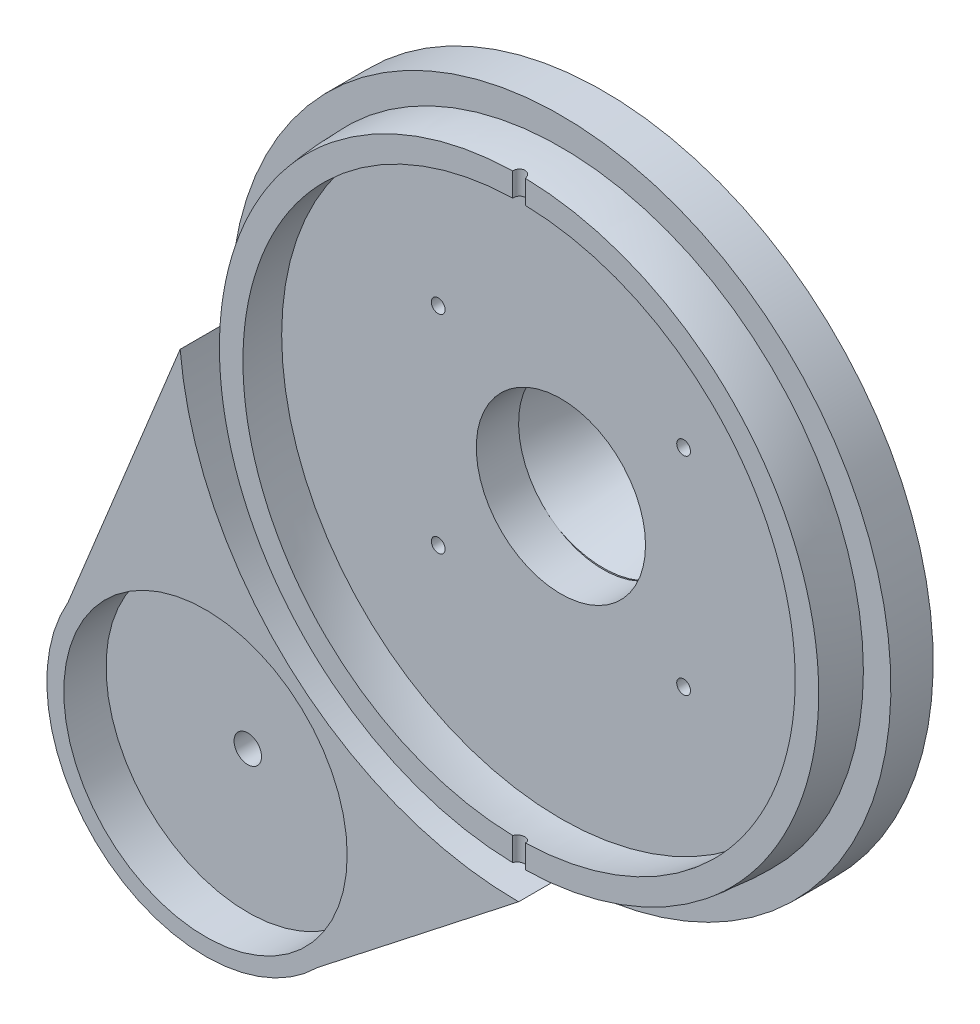
ISO-10303-21;
HEADER;
FILE_DESCRIPTION(('STEP AP214'),'2;1');
FILE_NAME('part.step','',(''),(''),'','','');
FILE_SCHEMA(('AUTOMOTIVE_DESIGN { 1 0 10303 214 1 1 1 1 }'));
ENDSEC;
DATA;
#1=APPLICATION_CONTEXT('core data for automotive mechanical design processes');
#2=APPLICATION_PROTOCOL_DEFINITION('international standard','automotive_design',2000,#1);
#3=PRODUCT_CONTEXT('',#1,'mechanical');
#4=PRODUCT('Part','Part','',(#3));
#5=PRODUCT_RELATED_PRODUCT_CATEGORY('part','',(#4));
#6=PRODUCT_DEFINITION_FORMATION('','',#4);
#7=PRODUCT_DEFINITION_CONTEXT('part definition',#1,'design');
#8=PRODUCT_DEFINITION('design','',#6,#7);
#9=PRODUCT_DEFINITION_SHAPE('','',#8);
#10=(LENGTH_UNIT() NAMED_UNIT(*) SI_UNIT(.MILLI.,.METRE.));
#11=(NAMED_UNIT(*) PLANE_ANGLE_UNIT() SI_UNIT($,.RADIAN.));
#12=(NAMED_UNIT(*) SI_UNIT($,.STERADIAN.) SOLID_ANGLE_UNIT());
#13=UNCERTAINTY_MEASURE_WITH_UNIT(LENGTH_MEASURE(1.E-05),#10,'distance_accuracy_value','');
#14=(GEOMETRIC_REPRESENTATION_CONTEXT(3) GLOBAL_UNCERTAINTY_ASSIGNED_CONTEXT((#13)) GLOBAL_UNIT_ASSIGNED_CONTEXT((#10,
#11,#12)) REPRESENTATION_CONTEXT('',''));
#15=CARTESIAN_POINT('',(0.,0.,0.));
#16=DIRECTION('',(0.,0.,1.));
#17=DIRECTION('',(1.,0.,0.));
#18=AXIS2_PLACEMENT_3D('',#15,#16,#17);
#19=CARTESIAN_POINT('',(0.,0.,0.));
#20=DIRECTION('',(0.,0.,1.));
#21=DIRECTION('',(1.,0.,0.));
#22=AXIS2_PLACEMENT_3D('',#19,#20,#21);
#23=PLANE('',#22);
#24=CARTESIAN_POINT('',(0.,0.,0.));
#25=DIRECTION('',(0.,0.,-1.));
#26=DIRECTION('',(-1.,0.,0.));
#27=AXIS2_PLACEMENT_3D('',#24,#25,#26);
#28=CIRCLE('',#27,71.5);
#29=CARTESIAN_POINT('',(-71.5,0.,0.));
#30=VERTEX_POINT('',#29);
#31=EDGE_CURVE('E621',#30,#30,#28,.T.);
#32=ORIENTED_EDGE('',*,*,#31,.T.);
#33=EDGE_LOOP('',(#32));
#34=FACE_BOUND('',#33,.T.);
#35=CARTESIAN_POINT('',(0.,2.32165108694269,0.));
#36=DIRECTION('',(0.,0.,1.));
#37=DIRECTION('',(1.,0.,0.));
#38=AXIS2_PLACEMENT_3D('',#35,#36,#37);
#39=CIRCLE('',#38,80.3216510869438);
#40=CARTESIAN_POINT('',(-79.9963372707255,-4.90009777334602,0.));
#41=VERTEX_POINT('',#40);
#42=CARTESIAN_POINT('',(0.,-78.0000000000012,0.));
#43=VERTEX_POINT('',#42);
#44=EDGE_CURVE('E80',#41,#43,#39,.T.);
#45=ORIENTED_EDGE('',*,*,#44,.T.);
#46=CARTESIAN_POINT('',(0.,0.,0.));
#47=DIRECTION('',(0.,0.,1.));
#48=DIRECTION('',(1.,0.,0.));
#49=AXIS2_PLACEMENT_3D('',#46,#47,#48);
#50=CIRCLE('',#49,78.0000000000012);
#51=CARTESIAN_POINT('',(-78.0000000000012,0.,0.));
#52=VERTEX_POINT('',#51);
#53=EDGE_CURVE('E216',#43,#52,#50,.T.);
#54=ORIENTED_EDGE('',*,*,#53,.T.);
#55=DIRECTION('',(-0.377297072233503,-0.926092284431755,0.));
#56=VECTOR('',#55,1.);
#57=CARTESIAN_POINT('',(-66.8964597041551,27.2541287876631,0.));
#58=LINE('',#57,#56);
#59=EDGE_CURVE('E76',#52,#41,#58,.T.);
#60=ORIENTED_EDGE('',*,*,#59,.T.);
#61=EDGE_LOOP('',(#45,#54,#60));
#62=FACE_BOUND('',#61,.T.);
#63=ADVANCED_FACE('F58',(#34,#62),#23,.T.);
#64=CARTESIAN_POINT('',(-74.0070931617323,-88.6746872661566,0.));
#65=DIRECTION('',(0.,0.,-1.));
#66=DIRECTION('',(-1.,0.,0.));
#67=AXIS2_PLACEMENT_3D('',#64,#65,#66);
#68=CIRCLE('',#67,3.25000000000001);
#69=CARTESIAN_POINT('',(-77.2570931617323,-88.6746872661566,0.));
#70=VERTEX_POINT('',#69);
#71=EDGE_CURVE('E177',#70,#70,#68,.T.);
#72=ORIENTED_EDGE('',*,*,#71,.T.);
#73=EDGE_LOOP('',(#72));
#74=FACE_BOUND('',#73,.T.);
#75=CARTESIAN_POINT('',(-74.0070931617323,-88.6746872661566,0.));
#76=DIRECTION('',(0.,0.,1.));
#77=DIRECTION('',(1.,0.,0.));
#78=AXIS2_PLACEMENT_3D('',#75,#76,#77);
#79=CIRCLE('',#78,33.5);
#80=CARTESIAN_POINT('',(-40.5070931617323,-88.6746872661566,0.));
#81=VERTEX_POINT('',#80);
#82=EDGE_CURVE('E12',#81,#81,#79,.F.);
#83=ORIENTED_EDGE('',*,*,#82,.F.);
#84=EDGE_LOOP('',(#83));
#85=FACE_BOUND('',#84,.T.);
#86=ADVANCED_FACE('F278',(#74,#85),#23,.T.);
#87=CARTESIAN_POINT('',(0.,0.,-10.));
#88=DIRECTION('',(0.,0.,1.));
#89=DIRECTION('',(1.,0.,0.));
#90=AXIS2_PLACEMENT_3D('',#87,#88,#89);
#91=CYLINDRICAL_SURFACE('',#90,78.0000000000012);
#92=ORIENTED_EDGE('',*,*,#53,.F.);
#93=DIRECTION('',(0.,0.,-1.));
#94=VECTOR('',#93,1.);
#95=CARTESIAN_POINT('',(0.,-78.0000000000011,0.));
#96=LINE('',#95,#94);
#97=CARTESIAN_POINT('',(0.,-78.0000000000011,-10.));
#98=VERTEX_POINT('',#97);
#99=EDGE_CURVE('E193',#43,#98,#96,.T.);
#100=ORIENTED_EDGE('',*,*,#99,.T.);
#101=CARTESIAN_POINT('',(0.,0.,-10.));
#102=DIRECTION('',(0.,0.,1.));
#103=DIRECTION('',(1.,0.,0.));
#104=AXIS2_PLACEMENT_3D('',#101,#102,#103);
#105=CIRCLE('',#104,78.0000000000012);
#106=CARTESIAN_POINT('',(-78.0000000000012,0.,-10.));
#107=VERTEX_POINT('',#106);
#108=EDGE_CURVE('E203',#98,#107,#105,.T.);
#109=ORIENTED_EDGE('',*,*,#108,.T.);
#110=DIRECTION('',(0.,0.,-1.));
#111=VECTOR('',#110,1.);
#112=CARTESIAN_POINT('',(-78.0000000000012,0.,0.));
#113=LINE('',#112,#111);
#114=EDGE_CURVE('E196',#52,#107,#113,.T.);
#115=ORIENTED_EDGE('',*,*,#114,.F.);
#116=EDGE_LOOP('',(#92,#100,#109,#115));
#117=FACE_BOUND('',#116,.T.);
#118=ADVANCED_FACE('F243',(#117),#91,.T.);
#119=CARTESIAN_POINT('',(0.,0.,9.88765871070188));
#120=DIRECTION('',(0.,0.,1.));
#121=DIRECTION('',(1.,0.,0.));
#122=AXIS2_PLACEMENT_3D('',#119,#120,#121);
#123=PLANE('',#122);
#124=DIRECTION('',(0.,1.,0.));
#125=VECTOR('',#124,1.);
#126=CARTESIAN_POINT('',(1.49578722909338,-78.0000000000012,9.88765871070189));
#127=LINE('',#126,#125);
#128=CARTESIAN_POINT('',(1.49578722909338,-70.7972232914961,9.88765871070189));
#129=VERTEX_POINT('',#128);
#130=CARTESIAN_POINT('',(1.49578722909338,-65.2380013932521,9.88765871070189));
#131=VERTEX_POINT('',#130);
#132=EDGE_CURVE('E68',#129,#131,#127,.T.);
#133=ORIENTED_EDGE('',*,*,#132,.F.);
#134=CARTESIAN_POINT('',(0.,0.,9.88765871070188));
#135=DIRECTION('',(0.,0.,1.));
#136=DIRECTION('',(1.,0.,0.));
#137=AXIS2_PLACEMENT_3D('',#134,#135,#136);
#138=CIRCLE('',#137,70.8130228504664);
#139=CARTESIAN_POINT('',(1.49578722909338,70.7972232914961,9.88765871070189));
#140=VERTEX_POINT('',#139);
#141=EDGE_CURVE('E260',#129,#140,#138,.T.);
#142=ORIENTED_EDGE('',*,*,#141,.T.);
#143=CARTESIAN_POINT('',(1.49578722909338,65.2380013932521,9.88765871070189));
#144=VERTEX_POINT('',#143);
#145=EDGE_CURVE('E612',#144,#140,#127,.T.);
#146=ORIENTED_EDGE('',*,*,#145,.F.);
#147=CARTESIAN_POINT('',(0.,0.,9.88765871070188));
#148=DIRECTION('',(0.,0.,1.));
#149=DIRECTION('',(1.,0.,0.));
#150=AXIS2_PLACEMENT_3D('',#147,#148,#149);
#151=CIRCLE('',#150,65.2551469634441);
#152=EDGE_CURVE('E261',#144,#131,#151,.F.);
#153=ORIENTED_EDGE('',*,*,#152,.T.);
#154=EDGE_LOOP('',(#133,#142,#146,#153));
#155=FACE_BOUND('',#154,.T.);
#156=ADVANCED_FACE('F266',(#155),#123,.T.);
#157=CARTESIAN_POINT('',(0.,0.,0.));
#158=DIRECTION('',(-1.,0.,0.));
#159=DIRECTION('',(0.,1.,0.));
#160=AXIS2_PLACEMENT_3D('',#157,#158,#159);
#161=SPHERICAL_SURFACE('',#160,66.);
#162=CARTESIAN_POINT('',(0.,0.,0.));
#163=DIRECTION('',(0.,0.,1.));
#164=DIRECTION('',(-1.,0.,0.));
#165=AXIS2_PLACEMENT_3D('',#162,#163,#164);
#166=CIRCLE('',#165,66.);
#167=CARTESIAN_POINT('',(-66.,0.,0.));
#168=VERTEX_POINT('',#167);
#169=EDGE_CURVE('E314',#168,#168,#166,.T.);
#170=ORIENTED_EDGE('',*,*,#169,.F.);
#171=EDGE_LOOP('',(#170));
#172=FACE_BOUND('',#171,.T.);
#173=ORIENTED_EDGE('',*,*,#152,.F.);
#174=CARTESIAN_POINT('',(1.49580223667257,65.2379707362664,9.88785871070234));
#175=CARTESIAN_POINT('',(1.49262410187074,65.2444676252272,9.84547436025111));
#176=CARTESIAN_POINT('',(1.48764573330495,65.2509402491417,9.80324190147573));
#177=CARTESIAN_POINT('',(1.474122516832,65.2637974516512,9.7193391709444));
#178=CARTESIAN_POINT('',(1.46557772843855,65.2701820317135,9.67766888981923));
#179=CARTESIAN_POINT('',(1.43466963356243,65.289129330821,9.55398750293752));
#180=CARTESIAN_POINT('',(1.40702466359359,65.3015016595283,9.47320113894301));
#181=CARTESIAN_POINT('',(1.33838207350703,65.3253621405282,9.31736020511043));
#182=CARTESIAN_POINT('',(1.2973762482151,65.3368497441196,9.24230919252319));
#183=CARTESIAN_POINT('',(1.20313074829694,65.3586050843083,9.1001429909393));
#184=CARTESIAN_POINT('',(1.14989484028291,65.3688731950102,9.03302536824173));
#185=CARTESIAN_POINT('',(1.03302146392251,65.3878293631549,8.90909303465792));
#186=CARTESIAN_POINT('',(0.969450347937833,65.3965267980916,8.85221718302946));
#187=CARTESIAN_POINT('',(0.833444958537618,65.4121618718752,8.74995702812555));
#188=CARTESIAN_POINT('',(0.761009731881607,65.4190993212073,8.70457396239015));
#189=CARTESIAN_POINT('',(0.61022233542998,65.430934076958,8.62714503010273));
#190=CARTESIAN_POINT('',(0.531946524793048,65.4358536130643,8.59495384341899));
#191=CARTESIAN_POINT('',(0.3710114013796,65.4436154719849,8.54416045738107));
#192=CARTESIAN_POINT('',(0.288352610338821,65.4464580414418,8.52555664450769));
#193=CARTESIAN_POINT('',(0.121822096570623,65.4499631883822,8.50261608609233));
#194=CARTESIAN_POINT('',(0.0379688956901759,65.4506458653412,8.4981477985604));
#195=CARTESIAN_POINT('',(-0.129298920513545,65.4498674235649,8.50324271926474));
#196=CARTESIAN_POINT('',(-0.212713546732094,65.4484063583402,8.51280557726407));
#197=CARTESIAN_POINT('',(-0.376447104407086,65.4433931516693,8.54561494853893));
#198=CARTESIAN_POINT('',(-0.456775485730177,65.4398480444895,8.56881543072282));
#199=CARTESIAN_POINT('',(-0.612378577924732,65.4307778336302,8.62816662637793));
#200=CARTESIAN_POINT('',(-0.687653027614257,65.4252526277147,8.66431800852749));
#201=CARTESIAN_POINT('',(-0.831355552130187,65.4123579457064,8.74867347739999));
#202=CARTESIAN_POINT('',(-0.899754315473752,65.4049810067737,8.79692633467424));
#203=CARTESIAN_POINT('',(-1.02747944630808,65.3886090895122,8.90399340848082));
#204=CARTESIAN_POINT('',(-1.08680624565288,65.3796141882478,8.96280712199318));
#205=CARTESIAN_POINT('',(-1.19533296476678,65.3601678334868,9.08992780085658));
#206=CARTESIAN_POINT('',(-1.24442903304404,65.3497030933644,9.1583213456289));
#207=CARTESIAN_POINT('',(-1.33046473553455,65.3276790548363,9.30222352977206));
#208=CARTESIAN_POINT('',(-1.36740332839041,65.3161196627764,9.37773277793146));
#209=CARTESIAN_POINT('',(-1.42469899415503,65.2935868232277,9.52488156294708));
#210=CARTESIAN_POINT('',(-1.44645964545106,65.2826951445365,9.5959917339646));
#211=CARTESIAN_POINT('',(-1.47925719863528,65.2605484692334,9.74054694834235));
#212=CARTESIAN_POINT('',(-1.4902998455201,65.2492936706054,9.81399071903352));
#213=CARTESIAN_POINT('',(-1.49580223667257,65.2379707362664,9.88785871070234));
#214=B_SPLINE_CURVE_WITH_KNOTS('',3,(#174,#175,#176,#177,#178,#179,#180,#181,#182,#183,#184,
#185,#186,#187,#188,#189,#190,#191,#192,#193,#194,#195,#196,#197,#198,#199,#200,#201,#202,#203,
#204,#205,#206,#207,#208,#209,#210,#211,#212,#213),.UNSPECIFIED.,.F.,.F.,(4,2,2,2,2,2,2,2,2,2,2,
2,2,2,2,2,2,2,2,4),(0.,0.128912497632018,0.257822844155858,0.51532886504822,0.772993324654421,
1.0305785350743,1.28657099523168,1.54259100887756,1.79570957863552,2.04879808532821,
2.29952437273985,2.55024440178033,2.80012299542591,3.05001449261375,3.30092974077472,
3.55183304085924,3.80517096394846,4.05853058123763,4.28321327070321,4.50777546056261),.UNSPECIFIED.);
#215=CARTESIAN_POINT('',(-1.49578722909337,65.2380013932521,9.88765871070187));
#216=VERTEX_POINT('',#215);
#217=EDGE_CURVE('E254',#144,#216,#214,.T.);
#218=ORIENTED_EDGE('',*,*,#217,.T.);
#219=CARTESIAN_POINT('',(-1.49578722909337,-65.2380013932521,9.88765871070187));
#220=VERTEX_POINT('',#219);
#221=EDGE_CURVE('E611',#220,#216,#151,.F.);
#222=ORIENTED_EDGE('',*,*,#221,.F.);
#223=CARTESIAN_POINT('',(-1.49580223667257,-65.2379707362664,9.88785871070234));
#224=CARTESIAN_POINT('',(-1.49262410187074,-65.2444676252272,9.84547436025111));
#225=CARTESIAN_POINT('',(-1.48764573330495,-65.2509402491417,9.80324190147573));
#226=CARTESIAN_POINT('',(-1.474122516832,-65.2637974516512,9.7193391709444));
#227=CARTESIAN_POINT('',(-1.46557772843855,-65.2701820317135,9.67766888981923));
#228=CARTESIAN_POINT('',(-1.43466963356243,-65.289129330821,9.55398750293752));
#229=CARTESIAN_POINT('',(-1.40702466359359,-65.3015016595283,9.47320113894301));
#230=CARTESIAN_POINT('',(-1.33838207350703,-65.3253621405282,9.31736020511043));
#231=CARTESIAN_POINT('',(-1.2973762482151,-65.3368497441196,9.24230919252319));
#232=CARTESIAN_POINT('',(-1.20313074829694,-65.3586050843083,9.1001429909393));
#233=CARTESIAN_POINT('',(-1.14989484028291,-65.3688731950102,9.03302536824173));
#234=CARTESIAN_POINT('',(-1.03302146392251,-65.3878293631549,8.90909303465792));
#235=CARTESIAN_POINT('',(-0.969450347937833,-65.3965267980916,8.85221718302946));
#236=CARTESIAN_POINT('',(-0.833444958537618,-65.4121618718752,8.74995702812555));
#237=CARTESIAN_POINT('',(-0.761009731881607,-65.4190993212073,8.70457396239015));
#238=CARTESIAN_POINT('',(-0.61022233542998,-65.430934076958,8.62714503010273));
#239=CARTESIAN_POINT('',(-0.531946524793048,-65.4358536130643,8.59495384341899));
#240=CARTESIAN_POINT('',(-0.3710114013796,-65.4436154719849,8.54416045738107));
#241=CARTESIAN_POINT('',(-0.288352610338821,-65.4464580414418,8.52555664450769));
#242=CARTESIAN_POINT('',(-0.121822096570623,-65.4499631883822,8.50261608609233));
#243=CARTESIAN_POINT('',(-0.0379688956901759,-65.4506458653412,8.4981477985604));
#244=CARTESIAN_POINT('',(0.129298920513545,-65.4498674235649,8.50324271926474));
#245=CARTESIAN_POINT('',(0.212713546732094,-65.4484063583402,8.51280557726407));
#246=CARTESIAN_POINT('',(0.376447104407086,-65.4433931516693,8.54561494853893));
#247=CARTESIAN_POINT('',(0.456775485730177,-65.4398480444895,8.56881543072282));
#248=CARTESIAN_POINT('',(0.612378577924732,-65.4307778336302,8.62816662637793));
#249=CARTESIAN_POINT('',(0.687653027614257,-65.4252526277147,8.66431800852749));
#250=CARTESIAN_POINT('',(0.831355552130187,-65.4123579457064,8.74867347739999));
#251=CARTESIAN_POINT('',(0.899754315473752,-65.4049810067737,8.79692633467424));
#252=CARTESIAN_POINT('',(1.02747944630808,-65.3886090895122,8.90399340848082));
#253=CARTESIAN_POINT('',(1.08680624565288,-65.3796141882478,8.96280712199318));
#254=CARTESIAN_POINT('',(1.19533296476678,-65.3601678334868,9.08992780085658));
#255=CARTESIAN_POINT('',(1.24442903304404,-65.3497030933644,9.1583213456289));
#256=CARTESIAN_POINT('',(1.33046473553455,-65.3276790548363,9.30222352977206));
#257=CARTESIAN_POINT('',(1.36740332839041,-65.3161196627764,9.37773277793146));
#258=CARTESIAN_POINT('',(1.42469899415503,-65.2935868232277,9.52488156294708));
#259=CARTESIAN_POINT('',(1.44645964545106,-65.2826951445365,9.5959917339646));
#260=CARTESIAN_POINT('',(1.47925719863528,-65.2605484692334,9.74054694834235));
#261=CARTESIAN_POINT('',(1.4902998455201,-65.2492936706054,9.81399071903352));
#262=CARTESIAN_POINT('',(1.49580223667257,-65.2379707362664,9.88785871070234));
#263=B_SPLINE_CURVE_WITH_KNOTS('',3,(#223,#224,#225,#226,#227,#228,#229,#230,#231,#232,#233,
#234,#235,#236,#237,#238,#239,#240,#241,#242,#243,#244,#245,#246,#247,#248,#249,#250,#251,#252,
#253,#254,#255,#256,#257,#258,#259,#260,#261,#262),.UNSPECIFIED.,.F.,.F.,(4,2,2,2,2,2,2,2,2,2,2,
2,2,2,2,2,2,2,2,4),(0.,0.128912497632018,0.257822844155858,0.51532886504822,0.772993324654421,
1.0305785350743,1.28657099523168,1.54259100887756,1.79570957863552,2.04879808532821,
2.29952437273985,2.55024440178033,2.80012299542591,3.05001449261375,3.30092974077472,
3.55183304085924,3.80517096394846,4.05853058123763,4.28321327070321,4.50777546056261),.UNSPECIFIED.);
#264=EDGE_CURVE('E230',#220,#131,#263,.T.);
#265=ORIENTED_EDGE('',*,*,#264,.T.);
#266=EDGE_LOOP('',(#173,#218,#222,#265));
#267=FACE_BOUND('',#266,.T.);
#268=ADVANCED_FACE('F263',(#172,#267),#161,.F.);
#269=CARTESIAN_POINT('',(0.,0.,0.));
#270=DIRECTION('',(-1.,0.,0.));
#271=DIRECTION('',(0.,-1.,0.));
#272=AXIS2_PLACEMENT_3D('',#269,#270,#271);
#273=SPHERICAL_SURFACE('',#272,71.5);
#274=ORIENTED_EDGE('',*,*,#31,.F.);
#275=EDGE_LOOP('',(#274));
#276=FACE_BOUND('',#275,.T.);
#277=CARTESIAN_POINT('',(-1.49578722909337,70.7972232914961,9.88765871070187));
#278=VERTEX_POINT('',#277);
#279=CARTESIAN_POINT('',(-1.49578722909337,-70.7972232914961,9.88765871070187));
#280=VERTEX_POINT('',#279);
#281=EDGE_CURVE('E609',#278,#280,#138,.T.);
#282=ORIENTED_EDGE('',*,*,#281,.F.);
#283=CARTESIAN_POINT('',(-1.49580223667257,70.7971950417949,9.88785871070238));
#284=CARTESIAN_POINT('',(-1.49262755274663,70.8031753490448,9.84551984231829));
#285=CARTESIAN_POINT('',(-1.48765645686983,70.8091334018571,9.80333309903756));
#286=CARTESIAN_POINT('',(-1.47415601459281,70.8209685553873,9.71952239056632));
#287=CARTESIAN_POINT('',(-1.4656267442746,70.8268456578334,9.67789841336221));
#288=CARTESIAN_POINT('',(-1.43477950530731,70.8442863930863,9.5543610014825));
#289=CARTESIAN_POINT('',(-1.40719380931359,70.8556749194063,9.47367259182691));
#290=CARTESIAN_POINT('',(-1.33871330097524,70.8776383388351,9.31802522921583));
#291=CARTESIAN_POINT('',(-1.29781061356081,70.8882127459242,9.24306969889583));
#292=CARTESIAN_POINT('',(-1.2038196338633,70.9082402538679,9.1010782217861));
#293=CARTESIAN_POINT('',(-1.15073488563121,70.9176936796319,9.03403998024359));
#294=CARTESIAN_POINT('',(-1.03415714718033,70.9351573722969,8.91017623073839));
#295=CARTESIAN_POINT('',(-0.970720088874003,70.943174933831,8.8532991050175));
#296=CARTESIAN_POINT('',(-0.835011893413674,70.9575918433632,8.75101059614789));
#297=CARTESIAN_POINT('',(-0.762739746924239,70.9639910062157,8.70560052483495));
#298=CARTESIAN_POINT('',(-0.612169835027228,70.974923724833,8.62801159946716));
#299=CARTESIAN_POINT('',(-0.533936919277698,70.9794746812901,8.59570933903264));
#300=CARTESIAN_POINT('',(-0.373082143799566,70.9866622310268,8.54468991619956));
#301=CARTESIAN_POINT('',(-0.290460765579249,70.9892990338663,8.52597126667897));
#302=CARTESIAN_POINT('',(-0.1238754852172,70.9925659899106,8.50277884256075));
#303=CARTESIAN_POINT('',(-0.0399274806355335,70.9932119312634,8.49819299053075));
#304=CARTESIAN_POINT('',(0.127548365692335,70.9925225856069,8.50308685238249));
#305=CARTESIAN_POINT('',(0.211076216189885,70.9911873400365,8.51256627207262));
#306=CARTESIAN_POINT('',(0.375091638662631,70.9865823714759,8.54525642155729));
#307=CARTESIAN_POINT('',(0.455587283976647,70.9833182385597,8.568427471868));
#308=CARTESIAN_POINT('',(0.611530664179233,70.9749564383536,8.62777879735185));
#309=CARTESIAN_POINT('',(0.686978147106211,70.9698586796254,8.66395972129429));
#310=CARTESIAN_POINT('',(0.830975468523236,70.9579578553646,8.74841261894589));
#311=CARTESIAN_POINT('',(0.899500434928023,70.9511489273179,8.79672615889791));
#312=CARTESIAN_POINT('',(1.02746535328482,70.9360322924955,8.90396897853307));
#313=CARTESIAN_POINT('',(1.08690578518028,70.9277246649481,8.96289769704895));
#314=CARTESIAN_POINT('',(1.19555277969382,70.909772590959,9.09021160752689));
#315=CARTESIAN_POINT('',(1.24467064266203,70.9001176571814,9.15867097440549));
#316=CARTESIAN_POINT('',(1.33073578876154,70.879795916376,9.30273170561588));
#317=CARTESIAN_POINT('',(1.36768226597908,70.8691290424041,9.37833354245147));
#318=CARTESIAN_POINT('',(1.42488828180128,70.8483639721517,9.52547084360965));
#319=CARTESIAN_POINT('',(1.44658478837292,70.838342975838,9.5964633021731));
#320=CARTESIAN_POINT('',(1.4792922997055,70.817967055832,9.74078241565418));
#321=CARTESIAN_POINT('',(1.49030874340352,70.8076123048869,9.81410786280073));
#322=CARTESIAN_POINT('',(1.49580223667257,70.7971950417949,9.88785871070238));
#323=B_SPLINE_CURVE_WITH_KNOTS('',3,(#283,#284,#285,#286,#287,#288,#289,#290,#291,#292,#293,
#294,#295,#296,#297,#298,#299,#300,#301,#302,#303,#304,#305,#306,#307,#308,#309,#310,#311,#312,
#313,#314,#315,#316,#317,#318,#319,#320,#321,#322),.UNSPECIFIED.,.F.,.F.,(4,2,2,2,2,2,2,2,2,2,2,
2,2,2,2,2,2,2,2,4),(0.,0.128552060091292,0.257101371582785,0.513871528594562,0.770793804565921,
1.02764143028596,1.28314469374193,1.53867717364878,1.7917447199868,2.04478455652618,
2.29581247704534,2.54683514709606,2.79713387612721,3.04744508865036,3.29862585255428,
3.5497933417805,3.80303799168292,4.05629940650849,4.28023129799852,4.5040490897616),.UNSPECIFIED.);
#324=EDGE_CURVE('E249',#278,#140,#323,.T.);
#325=ORIENTED_EDGE('',*,*,#324,.T.);
#326=ORIENTED_EDGE('',*,*,#141,.F.);
#327=CARTESIAN_POINT('',(1.49580223667257,-70.7971950417949,9.88785871070238));
#328=CARTESIAN_POINT('',(1.49262755274663,-70.8031753490448,9.84551984231829));
#329=CARTESIAN_POINT('',(1.48765645686983,-70.8091334018571,9.80333309903756));
#330=CARTESIAN_POINT('',(1.47415601459281,-70.8209685553873,9.71952239056632));
#331=CARTESIAN_POINT('',(1.4656267442746,-70.8268456578334,9.67789841336221));
#332=CARTESIAN_POINT('',(1.43477950530731,-70.8442863930863,9.5543610014825));
#333=CARTESIAN_POINT('',(1.40719380931359,-70.8556749194063,9.47367259182691));
#334=CARTESIAN_POINT('',(1.33871330097524,-70.8776383388351,9.31802522921583));
#335=CARTESIAN_POINT('',(1.29781061356081,-70.8882127459242,9.24306969889583));
#336=CARTESIAN_POINT('',(1.2038196338633,-70.9082402538679,9.1010782217861));
#337=CARTESIAN_POINT('',(1.15073488563121,-70.9176936796319,9.03403998024359));
#338=CARTESIAN_POINT('',(1.03415714718033,-70.9351573722969,8.91017623073839));
#339=CARTESIAN_POINT('',(0.970720088874003,-70.943174933831,8.8532991050175));
#340=CARTESIAN_POINT('',(0.835011893413674,-70.9575918433632,8.75101059614789));
#341=CARTESIAN_POINT('',(0.762739746924239,-70.9639910062157,8.70560052483495));
#342=CARTESIAN_POINT('',(0.612169835027228,-70.974923724833,8.62801159946716));
#343=CARTESIAN_POINT('',(0.533936919277698,-70.9794746812901,8.59570933903264));
#344=CARTESIAN_POINT('',(0.373082143799566,-70.9866622310268,8.54468991619956));
#345=CARTESIAN_POINT('',(0.290460765579249,-70.9892990338663,8.52597126667897));
#346=CARTESIAN_POINT('',(0.1238754852172,-70.9925659899106,8.50277884256075));
#347=CARTESIAN_POINT('',(0.0399274806355335,-70.9932119312634,8.49819299053075));
#348=CARTESIAN_POINT('',(-0.127548365692335,-70.9925225856069,8.50308685238249));
#349=CARTESIAN_POINT('',(-0.211076216189885,-70.9911873400365,8.51256627207262));
#350=CARTESIAN_POINT('',(-0.375091638662631,-70.9865823714759,8.54525642155729));
#351=CARTESIAN_POINT('',(-0.455587283976647,-70.9833182385597,8.568427471868));
#352=CARTESIAN_POINT('',(-0.611530664179233,-70.9749564383536,8.62777879735185));
#353=CARTESIAN_POINT('',(-0.686978147106211,-70.9698586796254,8.66395972129429));
#354=CARTESIAN_POINT('',(-0.830975468523236,-70.9579578553646,8.74841261894589));
#355=CARTESIAN_POINT('',(-0.899500434928023,-70.9511489273179,8.79672615889791));
#356=CARTESIAN_POINT('',(-1.02746535328482,-70.9360322924955,8.90396897853307));
#357=CARTESIAN_POINT('',(-1.08690578518028,-70.9277246649481,8.96289769704895));
#358=CARTESIAN_POINT('',(-1.19555277969382,-70.909772590959,9.09021160752689));
#359=CARTESIAN_POINT('',(-1.24467064266203,-70.9001176571814,9.15867097440549));
#360=CARTESIAN_POINT('',(-1.33073578876154,-70.879795916376,9.30273170561588));
#361=CARTESIAN_POINT('',(-1.36768226597908,-70.8691290424041,9.37833354245147));
#362=CARTESIAN_POINT('',(-1.42488828180128,-70.8483639721517,9.52547084360965));
#363=CARTESIAN_POINT('',(-1.44658478837292,-70.838342975838,9.5964633021731));
#364=CARTESIAN_POINT('',(-1.4792922997055,-70.817967055832,9.74078241565418));
#365=CARTESIAN_POINT('',(-1.49030874340352,-70.8076123048869,9.81410786280073));
#366=CARTESIAN_POINT('',(-1.49580223667257,-70.7971950417949,9.88785871070238));
#367=B_SPLINE_CURVE_WITH_KNOTS('',3,(#327,#328,#329,#330,#331,#332,#333,#334,#335,#336,#337,
#338,#339,#340,#341,#342,#343,#344,#345,#346,#347,#348,#349,#350,#351,#352,#353,#354,#355,#356,
#357,#358,#359,#360,#361,#362,#363,#364,#365,#366),.UNSPECIFIED.,.F.,.F.,(4,2,2,2,2,2,2,2,2,2,2,
2,2,2,2,2,2,2,2,4),(0.,0.128552060091292,0.257101371582785,0.513871528594562,0.770793804565921,
1.02764143028596,1.28314469374193,1.53867717364878,1.7917447199868,2.04478455652618,
2.29581247704534,2.54683514709606,2.79713387612721,3.04744508865036,3.29862585255428,
3.5497933417805,3.80303799168292,4.05629940650849,4.28023129799852,4.5040490897616),.UNSPECIFIED.);
#368=EDGE_CURVE('E223',#129,#280,#367,.T.);
#369=ORIENTED_EDGE('',*,*,#368,.T.);
#370=EDGE_LOOP('',(#282,#325,#326,#369));
#371=FACE_BOUND('',#370,.T.);
#372=ADVANCED_FACE('F60',(#276,#371),#273,.T.);
#373=DIRECTION('',(0.,1.,0.));
#374=VECTOR('',#373,1.);
#375=CARTESIAN_POINT('',(-1.49578722909337,-78.0000000000012,9.88765871070187));
#376=LINE('',#375,#374);
#377=EDGE_CURVE('E606',#278,#216,#376,.F.);
#378=ORIENTED_EDGE('',*,*,#377,.F.);
#379=ORIENTED_EDGE('',*,*,#281,.T.);
#380=EDGE_CURVE('E613',#220,#280,#376,.F.);
#381=ORIENTED_EDGE('',*,*,#380,.F.);
#382=ORIENTED_EDGE('',*,*,#221,.T.);
#383=EDGE_LOOP('',(#378,#379,#381,#382));
#384=FACE_BOUND('',#383,.T.);
#385=ADVANCED_FACE('F241',(#384),#123,.T.);
#386=CARTESIAN_POINT('',(0.,-78.0000000000012,10.));
#387=DIRECTION('',(0.,1.,0.));
#388=DIRECTION('',(0.,0.,1.));
#389=AXIS2_PLACEMENT_3D('',#386,#387,#388);
#390=CYLINDRICAL_SURFACE('',#389,1.5);
#391=ORIENTED_EDGE('',*,*,#132,.T.);
#392=ORIENTED_EDGE('',*,*,#264,.F.);
#393=ORIENTED_EDGE('',*,*,#380,.T.);
#394=ORIENTED_EDGE('',*,*,#368,.F.);
#395=EDGE_LOOP('',(#391,#392,#393,#394));
#396=FACE_BOUND('',#395,.T.);
#397=ADVANCED_FACE('F235',(#396),#390,.F.);
#398=ORIENTED_EDGE('',*,*,#145,.T.);
#399=ORIENTED_EDGE('',*,*,#324,.F.);
#400=ORIENTED_EDGE('',*,*,#377,.T.);
#401=ORIENTED_EDGE('',*,*,#217,.F.);
#402=EDGE_LOOP('',(#398,#399,#400,#401));
#403=FACE_BOUND('',#402,.T.);
#404=ADVANCED_FACE('F240',(#403),#390,.F.);
#405=CARTESIAN_POINT('',(-29.,-24.5,0.));
#406=DIRECTION('',(0.,0.,1.));
#407=DIRECTION('',(1.,0.,0.));
#408=AXIS2_PLACEMENT_3D('',#405,#406,#407);
#409=CIRCLE('',#408,1.625);
#410=CARTESIAN_POINT('',(-27.375,-24.5,0.));
#411=VERTEX_POINT('',#410);
#412=EDGE_CURVE('E165',#411,#411,#409,.F.);
#413=ORIENTED_EDGE('',*,*,#412,.T.);
#414=EDGE_LOOP('',(#413));
#415=FACE_BOUND('',#414,.T.);
#416=CARTESIAN_POINT('',(29.,24.5,0.));
#417=DIRECTION('',(0.,0.,1.));
#418=DIRECTION('',(1.,0.,0.));
#419=AXIS2_PLACEMENT_3D('',#416,#417,#418);
#420=CIRCLE('',#419,1.625);
#421=CARTESIAN_POINT('',(30.625,24.5,0.));
#422=VERTEX_POINT('',#421);
#423=EDGE_CURVE('E303',#422,#422,#420,.F.);
#424=ORIENTED_EDGE('',*,*,#423,.T.);
#425=EDGE_LOOP('',(#424));
#426=FACE_BOUND('',#425,.T.);
#427=CARTESIAN_POINT('',(29.,-24.5,0.));
#428=DIRECTION('',(0.,0.,1.));
#429=DIRECTION('',(1.,0.,0.));
#430=AXIS2_PLACEMENT_3D('',#427,#428,#429);
#431=CIRCLE('',#430,1.625);
#432=CARTESIAN_POINT('',(30.625,-24.5,0.));
#433=VERTEX_POINT('',#432);
#434=EDGE_CURVE('E307',#433,#433,#431,.F.);
#435=ORIENTED_EDGE('',*,*,#434,.T.);
#436=EDGE_LOOP('',(#435));
#437=FACE_BOUND('',#436,.T.);
#438=CARTESIAN_POINT('',(-29.,24.5,0.));
#439=DIRECTION('',(0.,0.,1.));
#440=DIRECTION('',(1.,0.,0.));
#441=AXIS2_PLACEMENT_3D('',#438,#439,#440);
#442=CIRCLE('',#441,1.625);
#443=CARTESIAN_POINT('',(-27.375,24.5,0.));
#444=VERTEX_POINT('',#443);
#445=EDGE_CURVE('E311',#444,#444,#442,.F.);
#446=ORIENTED_EDGE('',*,*,#445,.T.);
#447=EDGE_LOOP('',(#446));
#448=FACE_BOUND('',#447,.T.);
#449=ORIENTED_EDGE('',*,*,#169,.T.);
#450=EDGE_LOOP('',(#449));
#451=FACE_BOUND('',#450,.T.);
#452=CARTESIAN_POINT('',(0.,0.,0.));
#453=DIRECTION('',(0.,0.,1.));
#454=DIRECTION('',(1.,0.,0.));
#455=AXIS2_PLACEMENT_3D('',#452,#453,#454);
#456=CIRCLE('',#455,20.);
#457=CARTESIAN_POINT('',(20.,0.,0.));
#458=VERTEX_POINT('',#457);
#459=EDGE_CURVE('E212',#458,#458,#456,.T.);
#460=ORIENTED_EDGE('',*,*,#459,.F.);
#461=EDGE_LOOP('',(#460));
#462=FACE_BOUND('',#461,.T.);
#463=ADVANCED_FACE('F280',(#415,#426,#437,#448,#451,#462),#23,.T.);
#464=CARTESIAN_POINT('',(0.,0.,-10.));
#465=DIRECTION('',(0.,0.,1.));
#466=DIRECTION('',(1.,0.,0.));
#467=AXIS2_PLACEMENT_3D('',#464,#465,#466);
#468=PLANE('',#467);
#469=CARTESIAN_POINT('',(0.,0.,-10.));
#470=DIRECTION('',(0.,0.,1.));
#471=DIRECTION('',(1.,0.,0.));
#472=AXIS2_PLACEMENT_3D('',#469,#470,#471);
#473=CIRCLE('',#472,20.);
#474=CARTESIAN_POINT('',(10.6481749012566,-16.9297481160308,-10.));
#475=VERTEX_POINT('',#474);
#476=CARTESIAN_POINT('',(-10.6481749012566,-16.9297481160308,-10.));
#477=VERTEX_POINT('',#476);
#478=EDGE_CURVE('E217',#475,#477,#473,.T.);
#479=ORIENTED_EDGE('',*,*,#478,.T.);
#480=CARTESIAN_POINT('',(0.,2.32165108694269,-10.));
#481=DIRECTION('',(0.,0.,-1.));
#482=DIRECTION('',(-1.,0.,0.));
#483=AXIS2_PLACEMENT_3D('',#480,#481,#482);
#484=CIRCLE('',#483,22.);
#485=EDGE_CURVE('E202',#477,#475,#484,.T.);
#486=ORIENTED_EDGE('',*,*,#485,.T.);
#487=EDGE_LOOP('',(#479,#486));
#488=FACE_BOUND('',#487,.T.);
#489=ADVANCED_FACE('F288',(#488),#468,.F.);
#490=CARTESIAN_POINT('',(-29.,-24.5,-10.));
#491=DIRECTION('',(0.,0.,1.));
#492=DIRECTION('',(1.,0.,0.));
#493=AXIS2_PLACEMENT_3D('',#490,#491,#492);
#494=CIRCLE('',#493,1.625);
#495=CARTESIAN_POINT('',(-27.375,-24.5,-10.));
#496=VERTEX_POINT('',#495);
#497=EDGE_CURVE('E63',#496,#496,#494,.F.);
#498=ORIENTED_EDGE('',*,*,#497,.F.);
#499=EDGE_LOOP('',(#498));
#500=FACE_BOUND('',#499,.T.);
#501=CARTESIAN_POINT('',(29.,24.5,-10.));
#502=DIRECTION('',(0.,0.,1.));
#503=DIRECTION('',(1.,0.,0.));
#504=AXIS2_PLACEMENT_3D('',#501,#502,#503);
#505=CIRCLE('',#504,1.625);
#506=CARTESIAN_POINT('',(30.625,24.5,-10.));
#507=VERTEX_POINT('',#506);
#508=EDGE_CURVE('E388',#507,#507,#505,.F.);
#509=ORIENTED_EDGE('',*,*,#508,.F.);
#510=EDGE_LOOP('',(#509));
#511=FACE_BOUND('',#510,.T.);
#512=CARTESIAN_POINT('',(29.,-24.5,-10.));
#513=DIRECTION('',(0.,0.,1.));
#514=DIRECTION('',(1.,0.,0.));
#515=AXIS2_PLACEMENT_3D('',#512,#513,#514);
#516=CIRCLE('',#515,1.625);
#517=CARTESIAN_POINT('',(30.625,-24.5,-10.));
#518=VERTEX_POINT('',#517);
#519=EDGE_CURVE('E385',#518,#518,#516,.F.);
#520=ORIENTED_EDGE('',*,*,#519,.F.);
#521=EDGE_LOOP('',(#520));
#522=FACE_BOUND('',#521,.T.);
#523=CARTESIAN_POINT('',(-29.,24.5,-10.));
#524=DIRECTION('',(0.,0.,1.));
#525=DIRECTION('',(1.,0.,0.));
#526=AXIS2_PLACEMENT_3D('',#523,#524,#525);
#527=CIRCLE('',#526,1.625);
#528=CARTESIAN_POINT('',(-27.375,24.5,-10.));
#529=VERTEX_POINT('',#528);
#530=EDGE_CURVE('E390',#529,#529,#527,.F.);
#531=ORIENTED_EDGE('',*,*,#530,.F.);
#532=EDGE_LOOP('',(#531));
#533=FACE_BOUND('',#532,.T.);
#534=CARTESIAN_POINT('',(0.,2.32165108694269,-10.));
#535=DIRECTION('',(0.,0.,-1.));
#536=DIRECTION('',(-1.,0.,0.));
#537=AXIS2_PLACEMENT_3D('',#534,#535,#536);
#538=CIRCLE('',#537,26.);
#539=CARTESIAN_POINT('',(-26.,2.32165108694269,-10.));
#540=VERTEX_POINT('',#539);
#541=EDGE_CURVE('E199',#540,#540,#538,.T.);
#542=ORIENTED_EDGE('',*,*,#541,.F.);
#543=EDGE_LOOP('',(#542));
#544=FACE_BOUND('',#543,.T.);
#545=ORIENTED_EDGE('',*,*,#108,.F.);
#546=DIRECTION('',(0.787306673127528,0.616561596638051,0.));
#547=VECTOR('',#546,1.);
#548=CARTESIAN_POINT('',(37.8629986353301,-48.3484402089894,-10.));
#549=LINE('',#548,#547);
#550=CARTESIAN_POINT('',(-47.490588867237,-115.191191560652,-10.));
#551=VERTEX_POINT('',#550);
#552=EDGE_CURVE('E185',#551,#98,#549,.T.);
#553=ORIENTED_EDGE('',*,*,#552,.F.);
#554=CARTESIAN_POINT('',(-74.0070931617323,-88.6746872661566,-10.));
#555=DIRECTION('',(0.,0.,-1.));
#556=DIRECTION('',(-1.,0.,0.));
#557=AXIS2_PLACEMENT_3D('',#554,#555,#556);
#558=CIRCLE('',#557,37.5);
#559=CARTESIAN_POINT('',(-106.499413054393,-69.9530647939191,-10.));
#560=VERTEX_POINT('',#559);
#561=EDGE_CURVE('E146',#560,#551,#558,.F.);
#562=ORIENTED_EDGE('',*,*,#561,.F.);
#563=DIRECTION('',(-0.377297072233503,-0.926092284431755,0.));
#564=VECTOR('',#563,1.);
#565=CARTESIAN_POINT('',(-66.8964597041551,27.2541287876631,-10.));
#566=LINE('',#565,#564);
#567=EDGE_CURVE('E183',#107,#560,#566,.T.);
#568=ORIENTED_EDGE('',*,*,#567,.F.);
#569=EDGE_LOOP('',(#545,#553,#562,#568));
#570=FACE_BOUND('',#569,.T.);
#571=CARTESIAN_POINT('',(-74.0070931617323,-88.6746872661566,-10.));
#572=DIRECTION('',(0.,0.,-1.));
#573=DIRECTION('',(-1.,0.,0.));
#574=AXIS2_PLACEMENT_3D('',#571,#572,#573);
#575=CIRCLE('',#574,3.25000000000001);
#576=CARTESIAN_POINT('',(-77.2570931617323,-88.6746872661566,-10.));
#577=VERTEX_POINT('',#576);
#578=EDGE_CURVE('E178',#577,#577,#575,.T.);
#579=ORIENTED_EDGE('',*,*,#578,.F.);
#580=EDGE_LOOP('',(#579));
#581=FACE_BOUND('',#580,.T.);
#582=ADVANCED_FACE('F294',(#500,#511,#522,#533,#544,#570,#581),#468,.F.);
#583=CARTESIAN_POINT('',(0.,0.,-10.));
#584=DIRECTION('',(0.,0.,1.));
#585=DIRECTION('',(1.,0.,0.));
#586=AXIS2_PLACEMENT_3D('',#583,#584,#585);
#587=CYLINDRICAL_SURFACE('',#586,20.);
#588=EDGE_CURVE('E213',#477,#475,#473,.T.);
#589=ORIENTED_EDGE('',*,*,#588,.F.);
#590=ORIENTED_EDGE('',*,*,#478,.F.);
#591=EDGE_LOOP('',(#589,#590));
#592=FACE_BOUND('',#591,.T.);
#593=ORIENTED_EDGE('',*,*,#459,.T.);
#594=EDGE_LOOP('',(#593));
#595=FACE_BOUND('',#594,.T.);
#596=ADVANCED_FACE('F317',(#592,#595),#587,.F.);
#597=CARTESIAN_POINT('',(26.,2.32165108694269,-10.));
#598=DIRECTION('',(0.,0.,1.));
#599=DIRECTION('',(1.,0.,0.));
#600=AXIS2_PLACEMENT_3D('',#597,#598,#599);
#601=PLANE('',#600);
#602=EDGE_CURVE('E209',#475,#477,#484,.T.);
#603=ORIENTED_EDGE('',*,*,#602,.T.);
#604=ORIENTED_EDGE('',*,*,#588,.T.);
#605=EDGE_LOOP('',(#603,#604));
#606=FACE_BOUND('',#605,.T.);
#607=ADVANCED_FACE('F319',(#606),#601,.T.);
#608=CARTESIAN_POINT('',(0.,2.32165108694269,-10.));
#609=DIRECTION('',(0.,0.,1.));
#610=DIRECTION('',(1.,0.,0.));
#611=AXIS2_PLACEMENT_3D('',#608,#609,#610);
#612=CONICAL_SURFACE('',#611,22.,0.245077821890826);
#613=CARTESIAN_POINT('',(0.,2.32165108694269,-29.5166923016552));
#614=DIRECTION('',(0.,0.,-1.));
#615=DIRECTION('',(-1.,0.,0.));
#616=AXIS2_PLACEMENT_3D('',#613,#614,#615);
#617=CIRCLE('',#616,17.1187706693274);
#618=CARTESIAN_POINT('',(-17.1187706693274,2.32165108694269,-29.5166923016552));
#619=VERTEX_POINT('',#618);
#620=EDGE_CURVE('E206',#619,#619,#617,.T.);
#621=ORIENTED_EDGE('',*,*,#620,.T.);
#622=EDGE_LOOP('',(#621));
#623=FACE_BOUND('',#622,.T.);
#624=ORIENTED_EDGE('',*,*,#602,.F.);
#625=ORIENTED_EDGE('',*,*,#485,.F.);
#626=EDGE_LOOP('',(#624,#625));
#627=FACE_BOUND('',#626,.T.);
#628=ADVANCED_FACE('F326',(#623,#627),#612,.F.);
#629=CARTESIAN_POINT('',(21.1187706693274,2.32165108694269,-29.5166923016552));
#630=DIRECTION('',(0.,0.,1.));
#631=DIRECTION('',(1.,0.,0.));
#632=AXIS2_PLACEMENT_3D('',#629,#630,#631);
#633=PLANE('',#632);
#634=ORIENTED_EDGE('',*,*,#620,.F.);
#635=EDGE_LOOP('',(#634));
#636=FACE_BOUND('',#635,.T.);
#637=CARTESIAN_POINT('',(0.,2.32165108694269,-29.5166923016552));
#638=DIRECTION('',(0.,0.,-1.));
#639=DIRECTION('',(-1.,0.,0.));
#640=AXIS2_PLACEMENT_3D('',#637,#638,#639);
#641=CIRCLE('',#640,21.1187706693274);
#642=CARTESIAN_POINT('',(-21.1187706693274,2.32165108694269,-29.5166923016552));
#643=VERTEX_POINT('',#642);
#644=EDGE_CURVE('E192',#643,#643,#641,.T.);
#645=ORIENTED_EDGE('',*,*,#644,.T.);
#646=EDGE_LOOP('',(#645));
#647=FACE_BOUND('',#646,.T.);
#648=ADVANCED_FACE('F334',(#636,#647),#633,.F.);
#649=CARTESIAN_POINT('',(0.,2.32165108694269,-10.));
#650=DIRECTION('',(0.,0.,1.));
#651=DIRECTION('',(1.,0.,0.));
#652=AXIS2_PLACEMENT_3D('',#649,#650,#651);
#653=CONICAL_SURFACE('',#652,26.,0.245077821890826);
#654=ORIENTED_EDGE('',*,*,#644,.F.);
#655=EDGE_LOOP('',(#654));
#656=FACE_BOUND('',#655,.T.);
#657=ORIENTED_EDGE('',*,*,#541,.T.);
#658=EDGE_LOOP('',(#657));
#659=FACE_BOUND('',#658,.T.);
#660=ADVANCED_FACE('F338',(#656,#659),#653,.T.);
#661=CARTESIAN_POINT('',(-74.0070931617323,-88.6746872661566,0.));
#662=DIRECTION('',(0.,0.,-1.));
#663=DIRECTION('',(-1.,0.,0.));
#664=AXIS2_PLACEMENT_3D('',#661,#662,#663);
#665=CYLINDRICAL_SURFACE('',#664,37.5);
#666=ORIENTED_EDGE('',*,*,#561,.T.);
#667=DIRECTION('',(0.,0.,-1.));
#668=VECTOR('',#667,1.);
#669=CARTESIAN_POINT('',(-47.490588867237,-115.191191560652,0.));
#670=LINE('',#669,#668);
#671=CARTESIAN_POINT('',(-47.490588867237,-115.191191560652,10.));
#672=VERTEX_POINT('',#671);
#673=EDGE_CURVE('E189',#672,#551,#670,.T.);
#674=ORIENTED_EDGE('',*,*,#673,.F.);
#675=CARTESIAN_POINT('',(-74.0070931617323,-88.6746872661566,10.));
#676=DIRECTION('',(0.,0.,1.));
#677=DIRECTION('',(1.,0.,0.));
#678=AXIS2_PLACEMENT_3D('',#675,#676,#677);
#679=CIRCLE('',#678,37.5);
#680=CARTESIAN_POINT('',(-106.499413054393,-69.9530647939191,10.));
#681=VERTEX_POINT('',#680);
#682=EDGE_CURVE('E157',#681,#672,#679,.T.);
#683=ORIENTED_EDGE('',*,*,#682,.F.);
#684=DIRECTION('',(0.,0.,-1.));
#685=VECTOR('',#684,1.);
#686=CARTESIAN_POINT('',(-106.499413054393,-69.9530647939191,0.));
#687=LINE('',#686,#685);
#688=EDGE_CURVE('E153',#681,#560,#687,.T.);
#689=ORIENTED_EDGE('',*,*,#688,.T.);
#690=EDGE_LOOP('',(#666,#674,#683,#689));
#691=FACE_BOUND('',#690,.T.);
#692=ADVANCED_FACE('F342',(#691),#665,.T.);
#693=CARTESIAN_POINT('',(37.8629986353301,-48.3484402089894,0.));
#694=DIRECTION('',(-0.616561596638051,0.787306673127528,0.));
#695=DIRECTION('',(-0.787306673127528,-0.616561596638051,0.));
#696=AXIS2_PLACEMENT_3D('',#693,#694,#695);
#697=PLANE('',#696);
#698=ORIENTED_EDGE('',*,*,#552,.T.);
#699=ORIENTED_EDGE('',*,*,#99,.F.);
#700=DIRECTION('',(0.,0.,-1.));
#701=VECTOR('',#700,1.);
#702=CARTESIAN_POINT('',(0.,-78.0000000000012,10.));
#703=LINE('',#702,#701);
#704=CARTESIAN_POINT('',(0.,-78.0000000000012,10.));
#705=VERTEX_POINT('',#704);
#706=EDGE_CURVE('E147',#705,#43,#703,.T.);
#707=ORIENTED_EDGE('',*,*,#706,.F.);
#708=DIRECTION('',(0.787306673127529,0.616561596638051,0.));
#709=VECTOR('',#708,1.);
#710=CARTESIAN_POINT('',(37.8629986353301,-48.3484402089894,10.));
#711=LINE('',#710,#709);
#712=EDGE_CURVE('E162',#672,#705,#711,.T.);
#713=ORIENTED_EDGE('',*,*,#712,.F.);
#714=ORIENTED_EDGE('',*,*,#673,.T.);
#715=EDGE_LOOP('',(#698,#699,#707,#713,#714));
#716=FACE_BOUND('',#715,.T.);
#717=ADVANCED_FACE('F346',(#716),#697,.F.);
#718=CARTESIAN_POINT('',(-66.8964597041551,27.2541287876631,0.));
#719=DIRECTION('',(0.926092284431755,-0.377297072233503,0.));
#720=DIRECTION('',(0.377297072233503,0.926092284431755,0.));
#721=AXIS2_PLACEMENT_3D('',#718,#719,#720);
#722=PLANE('',#721);
#723=ORIENTED_EDGE('',*,*,#567,.T.);
#724=ORIENTED_EDGE('',*,*,#688,.F.);
#725=DIRECTION('',(-0.377297072233503,-0.926092284431755,0.));
#726=VECTOR('',#725,1.);
#727=CARTESIAN_POINT('',(-66.8964597041551,27.2541287876631,10.));
#728=LINE('',#727,#726);
#729=CARTESIAN_POINT('',(-79.9963372707255,-4.90009777334602,10.));
#730=VERTEX_POINT('',#729);
#731=EDGE_CURVE('E150',#730,#681,#728,.T.);
#732=ORIENTED_EDGE('',*,*,#731,.F.);
#733=DIRECTION('',(0.,0.,-1.));
#734=VECTOR('',#733,1.);
#735=CARTESIAN_POINT('',(-79.9963372707255,-4.90009777334602,10.));
#736=LINE('',#735,#734);
#737=EDGE_CURVE('E139',#730,#41,#736,.T.);
#738=ORIENTED_EDGE('',*,*,#737,.T.);
#739=ORIENTED_EDGE('',*,*,#59,.F.);
#740=ORIENTED_EDGE('',*,*,#114,.T.);
#741=EDGE_LOOP('',(#723,#724,#732,#738,#739,#740));
#742=FACE_BOUND('',#741,.T.);
#743=ADVANCED_FACE('F151',(#742),#722,.F.);
#744=CARTESIAN_POINT('',(-74.0070931617323,-88.6746872661566,0.));
#745=DIRECTION('',(0.,0.,-1.));
#746=DIRECTION('',(-1.,0.,0.));
#747=AXIS2_PLACEMENT_3D('',#744,#745,#746);
#748=CYLINDRICAL_SURFACE('',#747,3.25000000000001);
#749=ORIENTED_EDGE('',*,*,#71,.F.);
#750=EDGE_LOOP('',(#749));
#751=FACE_BOUND('',#750,.T.);
#752=ORIENTED_EDGE('',*,*,#578,.T.);
#753=EDGE_LOOP('',(#752));
#754=FACE_BOUND('',#753,.T.);
#755=ADVANCED_FACE('F350',(#751,#754),#748,.F.);
#756=CARTESIAN_POINT('',(0.,2.32165108694269,10.));
#757=DIRECTION('',(0.,0.,-1.));
#758=DIRECTION('',(-1.,0.,0.));
#759=AXIS2_PLACEMENT_3D('',#756,#757,#758);
#760=CYLINDRICAL_SURFACE('',#759,80.3216510869438);
#761=ORIENTED_EDGE('',*,*,#44,.F.);
#762=ORIENTED_EDGE('',*,*,#737,.F.);
#763=CARTESIAN_POINT('',(0.,2.32165108694269,10.));
#764=DIRECTION('',(0.,0.,1.));
#765=DIRECTION('',(1.,0.,0.));
#766=AXIS2_PLACEMENT_3D('',#763,#764,#765);
#767=CIRCLE('',#766,80.3216510869438);
#768=EDGE_CURVE('E144',#730,#705,#767,.T.);
#769=ORIENTED_EDGE('',*,*,#768,.T.);
#770=ORIENTED_EDGE('',*,*,#706,.T.);
#771=EDGE_LOOP('',(#761,#762,#769,#770));
#772=FACE_BOUND('',#771,.T.);
#773=ADVANCED_FACE('F141',(#772),#760,.F.);
#774=CARTESIAN_POINT('',(-74.0070931617323,-88.6746872661566,10.));
#775=DIRECTION('',(0.,0.,-1.));
#776=DIRECTION('',(-1.,0.,0.));
#777=AXIS2_PLACEMENT_3D('',#774,#775,#776);
#778=CYLINDRICAL_SURFACE('',#777,33.5);
#779=CARTESIAN_POINT('',(-74.0070931617323,-88.6746872661566,10.));
#780=DIRECTION('',(0.,0.,1.));
#781=DIRECTION('',(1.,0.,0.));
#782=AXIS2_PLACEMENT_3D('',#779,#780,#781);
#783=CIRCLE('',#782,33.5);
#784=CARTESIAN_POINT('',(-40.5070931617323,-88.6746872661566,10.));
#785=VERTEX_POINT('',#784);
#786=EDGE_CURVE('E172',#785,#785,#783,.T.);
#787=ORIENTED_EDGE('',*,*,#786,.T.);
#788=EDGE_LOOP('',(#787));
#789=FACE_BOUND('',#788,.T.);
#790=ORIENTED_EDGE('',*,*,#82,.T.);
#791=EDGE_LOOP('',(#790));
#792=FACE_BOUND('',#791,.T.);
#793=ADVANCED_FACE('F359',(#789,#792),#778,.F.);
#794=CARTESIAN_POINT('',(0.,0.,10.));
#795=DIRECTION('',(0.,0.,1.));
#796=DIRECTION('',(1.,0.,0.));
#797=AXIS2_PLACEMENT_3D('',#794,#795,#796);
#798=PLANE('',#797);
#799=ORIENTED_EDGE('',*,*,#768,.F.);
#800=ORIENTED_EDGE('',*,*,#731,.T.);
#801=ORIENTED_EDGE('',*,*,#682,.T.);
#802=ORIENTED_EDGE('',*,*,#712,.T.);
#803=EDGE_LOOP('',(#799,#800,#801,#802));
#804=FACE_BOUND('',#803,.T.);
#805=ORIENTED_EDGE('',*,*,#786,.F.);
#806=EDGE_LOOP('',(#805));
#807=FACE_BOUND('',#806,.T.);
#808=ADVANCED_FACE('F159',(#804,#807),#798,.T.);
#809=CARTESIAN_POINT('',(-29.,24.5,-12.));
#810=DIRECTION('',(0.,0.,1.));
#811=DIRECTION('',(1.,0.,0.));
#812=AXIS2_PLACEMENT_3D('',#809,#810,#811);
#813=CYLINDRICAL_SURFACE('',#812,1.625);
#814=ORIENTED_EDGE('',*,*,#445,.F.);
#815=EDGE_LOOP('',(#814));
#816=FACE_BOUND('',#815,.T.);
#817=ORIENTED_EDGE('',*,*,#530,.T.);
#818=EDGE_LOOP('',(#817));
#819=FACE_BOUND('',#818,.T.);
#820=ADVANCED_FACE('F365',(#816,#819),#813,.F.);
#821=CARTESIAN_POINT('',(29.,-24.5,-12.));
#822=DIRECTION('',(0.,0.,1.));
#823=DIRECTION('',(1.,0.,0.));
#824=AXIS2_PLACEMENT_3D('',#821,#822,#823);
#825=CYLINDRICAL_SURFACE('',#824,1.625);
#826=ORIENTED_EDGE('',*,*,#434,.F.);
#827=EDGE_LOOP('',(#826));
#828=FACE_BOUND('',#827,.T.);
#829=ORIENTED_EDGE('',*,*,#519,.T.);
#830=EDGE_LOOP('',(#829));
#831=FACE_BOUND('',#830,.T.);
#832=ADVANCED_FACE('F368',(#828,#831),#825,.F.);
#833=CARTESIAN_POINT('',(29.,24.5,-12.));
#834=DIRECTION('',(0.,0.,1.));
#835=DIRECTION('',(1.,0.,0.));
#836=AXIS2_PLACEMENT_3D('',#833,#834,#835);
#837=CYLINDRICAL_SURFACE('',#836,1.625);
#838=ORIENTED_EDGE('',*,*,#423,.F.);
#839=EDGE_LOOP('',(#838));
#840=FACE_BOUND('',#839,.T.);
#841=ORIENTED_EDGE('',*,*,#508,.T.);
#842=EDGE_LOOP('',(#841));
#843=FACE_BOUND('',#842,.T.);
#844=ADVANCED_FACE('F370',(#840,#843),#837,.F.);
#845=CARTESIAN_POINT('',(-29.,-24.5,-12.));
#846=DIRECTION('',(0.,0.,1.));
#847=DIRECTION('',(1.,0.,0.));
#848=AXIS2_PLACEMENT_3D('',#845,#846,#847);
#849=CYLINDRICAL_SURFACE('',#848,1.625);
#850=ORIENTED_EDGE('',*,*,#412,.F.);
#851=EDGE_LOOP('',(#850));
#852=FACE_BOUND('',#851,.T.);
#853=ORIENTED_EDGE('',*,*,#497,.T.);
#854=EDGE_LOOP('',(#853));
#855=FACE_BOUND('',#854,.T.);
#856=ADVANCED_FACE('F373',(#852,#855),#849,.F.);
#857=CLOSED_SHELL('',(#63,#86,#118,#156,#268,#372,#385,#397,#404,#463,#489,#582,#596,#607,#628,
#648,#660,#692,#717,#743,#755,#773,#793,#808,#820,#832,#844,#856));
#858=MANIFOLD_SOLID_BREP('B2',#857);
#859=ADVANCED_BREP_SHAPE_REPRESENTATION('',(#18,#858),#14);
#860=SHAPE_DEFINITION_REPRESENTATION(#9,#859);
ENDSEC;
END-ISO-10303-21;
